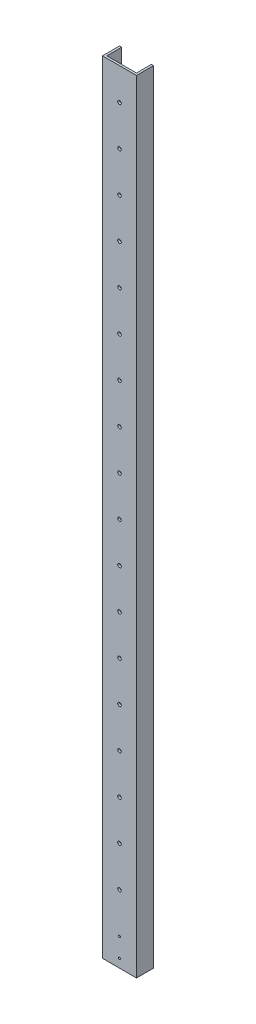
ISO-10303-21;
HEADER;
FILE_DESCRIPTION(('STEP AP214'),'2;1');
FILE_NAME('part.step','',(''),(''),'','','');
FILE_SCHEMA(('AUTOMOTIVE_DESIGN { 1 0 10303 214 1 1 1 1 }'));
ENDSEC;
DATA;
#1=APPLICATION_CONTEXT('core data for automotive mechanical design processes');
#2=APPLICATION_PROTOCOL_DEFINITION('international standard','automotive_design',2000,#1);
#3=PRODUCT_CONTEXT('',#1,'mechanical');
#4=PRODUCT('Part','Part','',(#3));
#5=PRODUCT_RELATED_PRODUCT_CATEGORY('part','',(#4));
#6=PRODUCT_DEFINITION_FORMATION('','',#4);
#7=PRODUCT_DEFINITION_CONTEXT('part definition',#1,'design');
#8=PRODUCT_DEFINITION('design','',#6,#7);
#9=PRODUCT_DEFINITION_SHAPE('','',#8);
#10=(LENGTH_UNIT() NAMED_UNIT(*) SI_UNIT(.MILLI.,.METRE.));
#11=(NAMED_UNIT(*) PLANE_ANGLE_UNIT() SI_UNIT($,.RADIAN.));
#12=(NAMED_UNIT(*) SI_UNIT($,.STERADIAN.) SOLID_ANGLE_UNIT());
#13=UNCERTAINTY_MEASURE_WITH_UNIT(LENGTH_MEASURE(1.E-05),#10,'distance_accuracy_value','');
#14=(GEOMETRIC_REPRESENTATION_CONTEXT(3) GLOBAL_UNCERTAINTY_ASSIGNED_CONTEXT((#13)) GLOBAL_UNIT_ASSIGNED_CONTEXT((#10,
#11,#12)) REPRESENTATION_CONTEXT('',''));
#15=CARTESIAN_POINT('',(0.,0.,0.));
#16=DIRECTION('',(0.,0.,1.));
#17=DIRECTION('',(1.,0.,0.));
#18=AXIS2_PLACEMENT_3D('',#15,#16,#17);
#19=CARTESIAN_POINT('',(0.,1168.4,0.));
#20=DIRECTION('',(1.,0.,0.));
#21=DIRECTION('',(0.,0.,-1.));
#22=AXIS2_PLACEMENT_3D('',#19,#20,#21);
#23=PLANE('',#22);
#24=DIRECTION('',(0.,0.,1.));
#25=VECTOR('',#24,1.);
#26=CARTESIAN_POINT('',(0.,0.,0.));
#27=LINE('',#26,#25);
#28=CARTESIAN_POINT('',(0.,0.,-25.4));
#29=VERTEX_POINT('',#28);
#30=CARTESIAN_POINT('',(0.,0.,0.));
#31=VERTEX_POINT('',#30);
#32=EDGE_CURVE('E129',#29,#31,#27,.T.);
#33=ORIENTED_EDGE('',*,*,#32,.T.);
#34=DIRECTION('',(0.,-1.,0.));
#35=VECTOR('',#34,1.);
#36=CARTESIAN_POINT('',(0.,1168.4,0.));
#37=LINE('',#36,#35);
#38=CARTESIAN_POINT('',(0.,1168.4,0.));
#39=VERTEX_POINT('',#38);
#40=EDGE_CURVE('E11',#39,#31,#37,.T.);
#41=ORIENTED_EDGE('',*,*,#40,.F.);
#42=DIRECTION('',(0.,0.,1.));
#43=VECTOR('',#42,1.);
#44=CARTESIAN_POINT('',(0.,1168.4,0.));
#45=LINE('',#44,#43);
#46=CARTESIAN_POINT('',(0.,1168.4,-25.4));
#47=VERTEX_POINT('',#46);
#48=EDGE_CURVE('E144',#47,#39,#45,.T.);
#49=ORIENTED_EDGE('',*,*,#48,.F.);
#50=DIRECTION('',(0.,-1.,0.));
#51=VECTOR('',#50,1.);
#52=CARTESIAN_POINT('',(0.,1168.4,-25.4));
#53=LINE('',#52,#51);
#54=EDGE_CURVE('E125',#47,#29,#53,.T.);
#55=ORIENTED_EDGE('',*,*,#54,.T.);
#56=EDGE_LOOP('',(#33,#41,#49,#55));
#57=FACE_BOUND('',#56,.T.);
#58=ADVANCED_FACE('F33',(#57),#23,.F.);
#59=CARTESIAN_POINT('',(0.,1168.4,0.));
#60=DIRECTION('',(0.,0.,-1.));
#61=DIRECTION('',(-1.,0.,0.));
#62=AXIS2_PLACEMENT_3D('',#59,#60,#61);
#63=PLANE('',#62);
#64=CARTESIAN_POINT('',(25.4,41.2749999999968,0.));
#65=DIRECTION('',(0.,0.,1.));
#66=DIRECTION('',(1.,0.,0.));
#67=AXIS2_PLACEMENT_3D('',#64,#65,#66);
#68=CIRCLE('',#67,1.5875);
#69=CARTESIAN_POINT('',(26.9875,41.2749999999968,0.));
#70=VERTEX_POINT('',#69);
#71=EDGE_CURVE('E288',#70,#70,#68,.T.);
#72=ORIENTED_EDGE('',*,*,#71,.F.);
#73=EDGE_LOOP('',(#72));
#74=FACE_BOUND('',#73,.T.);
#75=CARTESIAN_POINT('',(25.4,12.6999999999968,0.));
#76=DIRECTION('',(0.,0.,1.));
#77=DIRECTION('',(1.,0.,0.));
#78=AXIS2_PLACEMENT_3D('',#75,#76,#77);
#79=CIRCLE('',#78,1.5875);
#80=CARTESIAN_POINT('',(26.9875,12.6999999999968,0.));
#81=VERTEX_POINT('',#80);
#82=EDGE_CURVE('E289',#81,#81,#79,.T.);
#83=ORIENTED_EDGE('',*,*,#82,.F.);
#84=EDGE_LOOP('',(#83));
#85=FACE_BOUND('',#84,.T.);
#86=CARTESIAN_POINT('',(25.4,101.6,0.));
#87=DIRECTION('',(0.,0.,1.));
#88=DIRECTION('',(1.,0.,0.));
#89=AXIS2_PLACEMENT_3D('',#86,#87,#88);
#90=CIRCLE('',#89,2.667);
#91=CARTESIAN_POINT('',(28.067,101.6,0.));
#92=VERTEX_POINT('',#91);
#93=EDGE_CURVE('E278',#92,#92,#90,.T.);
#94=ORIENTED_EDGE('',*,*,#93,.F.);
#95=EDGE_LOOP('',(#94));
#96=FACE_BOUND('',#95,.T.);
#97=CARTESIAN_POINT('',(25.4,161.544,0.));
#98=DIRECTION('',(0.,0.,1.));
#99=DIRECTION('',(1.,0.,0.));
#100=AXIS2_PLACEMENT_3D('',#97,#98,#99);
#101=CIRCLE('',#100,2.667);
#102=CARTESIAN_POINT('',(28.067,161.544,0.));
#103=VERTEX_POINT('',#102);
#104=EDGE_CURVE('E272',#103,#103,#101,.T.);
#105=ORIENTED_EDGE('',*,*,#104,.F.);
#106=EDGE_LOOP('',(#105));
#107=FACE_BOUND('',#106,.T.);
#108=CARTESIAN_POINT('',(25.4,221.488,0.));
#109=DIRECTION('',(0.,0.,1.));
#110=DIRECTION('',(1.,0.,0.));
#111=AXIS2_PLACEMENT_3D('',#108,#109,#110);
#112=CIRCLE('',#111,2.667);
#113=CARTESIAN_POINT('',(28.067,221.488,0.));
#114=VERTEX_POINT('',#113);
#115=EDGE_CURVE('E266',#114,#114,#112,.T.);
#116=ORIENTED_EDGE('',*,*,#115,.F.);
#117=EDGE_LOOP('',(#116));
#118=FACE_BOUND('',#117,.T.);
#119=CARTESIAN_POINT('',(25.4,281.432,0.));
#120=DIRECTION('',(0.,0.,1.));
#121=DIRECTION('',(1.,0.,0.));
#122=AXIS2_PLACEMENT_3D('',#119,#120,#121);
#123=CIRCLE('',#122,2.667);
#124=CARTESIAN_POINT('',(28.067,281.432,0.));
#125=VERTEX_POINT('',#124);
#126=EDGE_CURVE('E260',#125,#125,#123,.T.);
#127=ORIENTED_EDGE('',*,*,#126,.F.);
#128=EDGE_LOOP('',(#127));
#129=FACE_BOUND('',#128,.T.);
#130=CARTESIAN_POINT('',(25.4,341.376,0.));
#131=DIRECTION('',(0.,0.,1.));
#132=DIRECTION('',(1.,0.,0.));
#133=AXIS2_PLACEMENT_3D('',#130,#131,#132);
#134=CIRCLE('',#133,2.667);
#135=CARTESIAN_POINT('',(28.067,341.376,0.));
#136=VERTEX_POINT('',#135);
#137=EDGE_CURVE('E254',#136,#136,#134,.T.);
#138=ORIENTED_EDGE('',*,*,#137,.F.);
#139=EDGE_LOOP('',(#138));
#140=FACE_BOUND('',#139,.T.);
#141=CARTESIAN_POINT('',(25.4,401.32,0.));
#142=DIRECTION('',(0.,0.,1.));
#143=DIRECTION('',(1.,0.,0.));
#144=AXIS2_PLACEMENT_3D('',#141,#142,#143);
#145=CIRCLE('',#144,2.667);
#146=CARTESIAN_POINT('',(28.067,401.32,0.));
#147=VERTEX_POINT('',#146);
#148=EDGE_CURVE('E248',#147,#147,#145,.T.);
#149=ORIENTED_EDGE('',*,*,#148,.F.);
#150=EDGE_LOOP('',(#149));
#151=FACE_BOUND('',#150,.T.);
#152=CARTESIAN_POINT('',(25.4,461.264,0.));
#153=DIRECTION('',(0.,0.,1.));
#154=DIRECTION('',(1.,0.,0.));
#155=AXIS2_PLACEMENT_3D('',#152,#153,#154);
#156=CIRCLE('',#155,2.667);
#157=CARTESIAN_POINT('',(28.067,461.264,0.));
#158=VERTEX_POINT('',#157);
#159=EDGE_CURVE('E242',#158,#158,#156,.T.);
#160=ORIENTED_EDGE('',*,*,#159,.F.);
#161=EDGE_LOOP('',(#160));
#162=FACE_BOUND('',#161,.T.);
#163=CARTESIAN_POINT('',(25.4,521.208,0.));
#164=DIRECTION('',(0.,0.,1.));
#165=DIRECTION('',(1.,0.,0.));
#166=AXIS2_PLACEMENT_3D('',#163,#164,#165);
#167=CIRCLE('',#166,2.667);
#168=CARTESIAN_POINT('',(28.067,521.208,0.));
#169=VERTEX_POINT('',#168);
#170=EDGE_CURVE('E236',#169,#169,#167,.T.);
#171=ORIENTED_EDGE('',*,*,#170,.F.);
#172=EDGE_LOOP('',(#171));
#173=FACE_BOUND('',#172,.T.);
#174=CARTESIAN_POINT('',(25.4,581.152,0.));
#175=DIRECTION('',(0.,0.,1.));
#176=DIRECTION('',(1.,0.,0.));
#177=AXIS2_PLACEMENT_3D('',#174,#175,#176);
#178=CIRCLE('',#177,2.667);
#179=CARTESIAN_POINT('',(28.067,581.152,0.));
#180=VERTEX_POINT('',#179);
#181=EDGE_CURVE('E230',#180,#180,#178,.T.);
#182=ORIENTED_EDGE('',*,*,#181,.F.);
#183=EDGE_LOOP('',(#182));
#184=FACE_BOUND('',#183,.T.);
#185=CARTESIAN_POINT('',(25.4,641.096,0.));
#186=DIRECTION('',(0.,0.,1.));
#187=DIRECTION('',(1.,0.,0.));
#188=AXIS2_PLACEMENT_3D('',#185,#186,#187);
#189=CIRCLE('',#188,2.66699999999997);
#190=CARTESIAN_POINT('',(28.067,641.096,0.));
#191=VERTEX_POINT('',#190);
#192=EDGE_CURVE('E224',#191,#191,#189,.T.);
#193=ORIENTED_EDGE('',*,*,#192,.F.);
#194=EDGE_LOOP('',(#193));
#195=FACE_BOUND('',#194,.T.);
#196=CARTESIAN_POINT('',(25.4,701.04,0.));
#197=DIRECTION('',(0.,0.,1.));
#198=DIRECTION('',(1.,0.,0.));
#199=AXIS2_PLACEMENT_3D('',#196,#197,#198);
#200=CIRCLE('',#199,2.66699999999994);
#201=CARTESIAN_POINT('',(28.0669999999999,701.04,0.));
#202=VERTEX_POINT('',#201);
#203=EDGE_CURVE('E218',#202,#202,#200,.T.);
#204=ORIENTED_EDGE('',*,*,#203,.F.);
#205=EDGE_LOOP('',(#204));
#206=FACE_BOUND('',#205,.T.);
#207=CARTESIAN_POINT('',(25.4,760.984,0.));
#208=DIRECTION('',(0.,0.,1.));
#209=DIRECTION('',(1.,0.,0.));
#210=AXIS2_PLACEMENT_3D('',#207,#208,#209);
#211=CIRCLE('',#210,2.667);
#212=CARTESIAN_POINT('',(28.067,760.984,0.));
#213=VERTEX_POINT('',#212);
#214=EDGE_CURVE('E212',#213,#213,#211,.T.);
#215=ORIENTED_EDGE('',*,*,#214,.F.);
#216=EDGE_LOOP('',(#215));
#217=FACE_BOUND('',#216,.T.);
#218=CARTESIAN_POINT('',(25.4,820.928,0.));
#219=DIRECTION('',(0.,0.,1.));
#220=DIRECTION('',(1.,0.,0.));
#221=AXIS2_PLACEMENT_3D('',#218,#219,#220);
#222=CIRCLE('',#221,2.667);
#223=CARTESIAN_POINT('',(28.067,820.928,0.));
#224=VERTEX_POINT('',#223);
#225=EDGE_CURVE('E206',#224,#224,#222,.T.);
#226=ORIENTED_EDGE('',*,*,#225,.F.);
#227=EDGE_LOOP('',(#226));
#228=FACE_BOUND('',#227,.T.);
#229=CARTESIAN_POINT('',(25.4,880.872,0.));
#230=DIRECTION('',(0.,0.,1.));
#231=DIRECTION('',(1.,0.,0.));
#232=AXIS2_PLACEMENT_3D('',#229,#230,#231);
#233=CIRCLE('',#232,2.667);
#234=CARTESIAN_POINT('',(28.067,880.872,0.));
#235=VERTEX_POINT('',#234);
#236=EDGE_CURVE('E200',#235,#235,#233,.T.);
#237=ORIENTED_EDGE('',*,*,#236,.F.);
#238=EDGE_LOOP('',(#237));
#239=FACE_BOUND('',#238,.T.);
#240=CARTESIAN_POINT('',(25.4,940.816,0.));
#241=DIRECTION('',(0.,0.,1.));
#242=DIRECTION('',(1.,0.,0.));
#243=AXIS2_PLACEMENT_3D('',#240,#241,#242);
#244=CIRCLE('',#243,2.667);
#245=CARTESIAN_POINT('',(28.067,940.816,0.));
#246=VERTEX_POINT('',#245);
#247=EDGE_CURVE('E194',#246,#246,#244,.T.);
#248=ORIENTED_EDGE('',*,*,#247,.F.);
#249=EDGE_LOOP('',(#248));
#250=FACE_BOUND('',#249,.T.);
#251=CARTESIAN_POINT('',(25.4,1000.76,0.));
#252=DIRECTION('',(0.,0.,1.));
#253=DIRECTION('',(1.,0.,0.));
#254=AXIS2_PLACEMENT_3D('',#251,#252,#253);
#255=CIRCLE('',#254,2.66700000000003);
#256=CARTESIAN_POINT('',(28.067,1000.76,0.));
#257=VERTEX_POINT('',#256);
#258=EDGE_CURVE('E188',#257,#257,#255,.T.);
#259=ORIENTED_EDGE('',*,*,#258,.F.);
#260=EDGE_LOOP('',(#259));
#261=FACE_BOUND('',#260,.T.);
#262=CARTESIAN_POINT('',(25.4,1060.704,0.));
#263=DIRECTION('',(0.,0.,1.));
#264=DIRECTION('',(1.,0.,0.));
#265=AXIS2_PLACEMENT_3D('',#262,#263,#264);
#266=CIRCLE('',#265,2.66700000000003);
#267=CARTESIAN_POINT('',(28.067,1060.704,0.));
#268=VERTEX_POINT('',#267);
#269=EDGE_CURVE('E180',#268,#268,#266,.T.);
#270=ORIENTED_EDGE('',*,*,#269,.F.);
#271=EDGE_LOOP('',(#270));
#272=FACE_BOUND('',#271,.T.);
#273=CARTESIAN_POINT('',(25.4,1120.648,0.));
#274=DIRECTION('',(0.,0.,1.));
#275=DIRECTION('',(1.,0.,0.));
#276=AXIS2_PLACEMENT_3D('',#273,#274,#275);
#277=CIRCLE('',#276,2.66700000000003);
#278=CARTESIAN_POINT('',(28.067,1120.648,0.));
#279=VERTEX_POINT('',#278);
#280=EDGE_CURVE('E181',#279,#279,#277,.T.);
#281=ORIENTED_EDGE('',*,*,#280,.F.);
#282=EDGE_LOOP('',(#281));
#283=FACE_BOUND('',#282,.T.);
#284=DIRECTION('',(1.,0.,0.));
#285=VECTOR('',#284,1.);
#286=CARTESIAN_POINT('',(0.,0.,0.));
#287=LINE('',#286,#285);
#288=CARTESIAN_POINT('',(50.8,0.,0.));
#289=VERTEX_POINT('',#288);
#290=EDGE_CURVE('E132',#31,#289,#287,.T.);
#291=ORIENTED_EDGE('',*,*,#290,.T.);
#292=DIRECTION('',(0.,-1.,0.));
#293=VECTOR('',#292,1.);
#294=CARTESIAN_POINT('',(50.8,1168.4,0.));
#295=LINE('',#294,#293);
#296=CARTESIAN_POINT('',(50.8,1168.4,0.));
#297=VERTEX_POINT('',#296);
#298=EDGE_CURVE('E41',#297,#289,#295,.T.);
#299=ORIENTED_EDGE('',*,*,#298,.F.);
#300=DIRECTION('',(1.,0.,0.));
#301=VECTOR('',#300,1.);
#302=CARTESIAN_POINT('',(0.,1168.4,0.));
#303=LINE('',#302,#301);
#304=EDGE_CURVE('E92',#39,#297,#303,.T.);
#305=ORIENTED_EDGE('',*,*,#304,.F.);
#306=ORIENTED_EDGE('',*,*,#40,.T.);
#307=EDGE_LOOP('',(#291,#299,#305,#306));
#308=FACE_BOUND('',#307,.T.);
#309=ADVANCED_FACE('F300',(#74,#85,#96,#107,#118,#129,#140,#151,#162,#173,#184,#195,#206,#217,
#228,#239,#250,#261,#272,#283,#308),#63,.F.);
#310=CARTESIAN_POINT('',(50.8,1168.4,0.));
#311=DIRECTION('',(-1.,0.,0.));
#312=DIRECTION('',(0.,0.,1.));
#313=AXIS2_PLACEMENT_3D('',#310,#311,#312);
#314=PLANE('',#313);
#315=DIRECTION('',(0.,0.,-1.));
#316=VECTOR('',#315,1.);
#317=CARTESIAN_POINT('',(50.8,0.,0.));
#318=LINE('',#317,#316);
#319=CARTESIAN_POINT('',(50.8,0.,-25.4));
#320=VERTEX_POINT('',#319);
#321=EDGE_CURVE('E135',#289,#320,#318,.T.);
#322=ORIENTED_EDGE('',*,*,#321,.T.);
#323=DIRECTION('',(0.,-1.,0.));
#324=VECTOR('',#323,1.);
#325=CARTESIAN_POINT('',(50.8,1168.4,-25.4));
#326=LINE('',#325,#324);
#327=CARTESIAN_POINT('',(50.8,1168.4,-25.4));
#328=VERTEX_POINT('',#327);
#329=EDGE_CURVE('E151',#328,#320,#326,.T.);
#330=ORIENTED_EDGE('',*,*,#329,.F.);
#331=DIRECTION('',(0.,0.,-1.));
#332=VECTOR('',#331,1.);
#333=CARTESIAN_POINT('',(50.8,1168.4,0.));
#334=LINE('',#333,#332);
#335=EDGE_CURVE('E159',#297,#328,#334,.T.);
#336=ORIENTED_EDGE('',*,*,#335,.F.);
#337=ORIENTED_EDGE('',*,*,#298,.T.);
#338=EDGE_LOOP('',(#322,#330,#336,#337));
#339=FACE_BOUND('',#338,.T.);
#340=ADVANCED_FACE('F157',(#339),#314,.F.);
#341=CARTESIAN_POINT('',(50.8,1168.4,-25.4));
#342=DIRECTION('',(0.,0.,1.));
#343=DIRECTION('',(1.,0.,0.));
#344=AXIS2_PLACEMENT_3D('',#341,#342,#343);
#345=PLANE('',#344);
#346=DIRECTION('',(-1.,0.,0.));
#347=VECTOR('',#346,1.);
#348=CARTESIAN_POINT('',(50.8,0.,-25.4));
#349=LINE('',#348,#347);
#350=CARTESIAN_POINT('',(47.625,0.,-25.4));
#351=VERTEX_POINT('',#350);
#352=EDGE_CURVE('E137',#320,#351,#349,.T.);
#353=ORIENTED_EDGE('',*,*,#352,.T.);
#354=DIRECTION('',(0.,-1.,0.));
#355=VECTOR('',#354,1.);
#356=CARTESIAN_POINT('',(47.625,1168.4,-25.4));
#357=LINE('',#356,#355);
#358=CARTESIAN_POINT('',(47.625,1168.4,-25.4));
#359=VERTEX_POINT('',#358);
#360=EDGE_CURVE('E148',#359,#351,#357,.T.);
#361=ORIENTED_EDGE('',*,*,#360,.F.);
#362=DIRECTION('',(-1.,0.,0.));
#363=VECTOR('',#362,1.);
#364=CARTESIAN_POINT('',(50.8,1168.4,-25.4));
#365=LINE('',#364,#363);
#366=EDGE_CURVE('E171',#328,#359,#365,.T.);
#367=ORIENTED_EDGE('',*,*,#366,.F.);
#368=ORIENTED_EDGE('',*,*,#329,.T.);
#369=EDGE_LOOP('',(#353,#361,#367,#368));
#370=FACE_BOUND('',#369,.T.);
#371=ADVANCED_FACE('F167',(#370),#345,.F.);
#372=CARTESIAN_POINT('',(47.625,1168.4,-3.175));
#373=DIRECTION('',(1.,0.,0.));
#374=DIRECTION('',(0.,0.,-1.));
#375=AXIS2_PLACEMENT_3D('',#372,#373,#374);
#376=PLANE('',#375);
#377=DIRECTION('',(0.,0.,1.));
#378=VECTOR('',#377,1.);
#379=CARTESIAN_POINT('',(47.625,0.,-3.175));
#380=LINE('',#379,#378);
#381=CARTESIAN_POINT('',(47.625,0.,-3.175));
#382=VERTEX_POINT('',#381);
#383=EDGE_CURVE('E139',#351,#382,#380,.T.);
#384=ORIENTED_EDGE('',*,*,#383,.T.);
#385=DIRECTION('',(0.,-1.,0.));
#386=VECTOR('',#385,1.);
#387=CARTESIAN_POINT('',(47.625,1168.4,-3.175));
#388=LINE('',#387,#386);
#389=CARTESIAN_POINT('',(47.625,1168.4,-3.175));
#390=VERTEX_POINT('',#389);
#391=EDGE_CURVE('E120',#390,#382,#388,.T.);
#392=ORIENTED_EDGE('',*,*,#391,.F.);
#393=DIRECTION('',(0.,0.,1.));
#394=VECTOR('',#393,1.);
#395=CARTESIAN_POINT('',(47.625,1168.4,-3.175));
#396=LINE('',#395,#394);
#397=EDGE_CURVE('E111',#359,#390,#396,.T.);
#398=ORIENTED_EDGE('',*,*,#397,.F.);
#399=ORIENTED_EDGE('',*,*,#360,.T.);
#400=EDGE_LOOP('',(#384,#392,#398,#399));
#401=FACE_BOUND('',#400,.T.);
#402=ADVANCED_FACE('F170',(#401),#376,.F.);
#403=CARTESIAN_POINT('',(3.175,1168.4,-3.175));
#404=DIRECTION('',(0.,0.,1.));
#405=DIRECTION('',(1.,0.,0.));
#406=AXIS2_PLACEMENT_3D('',#403,#404,#405);
#407=PLANE('',#406);
#408=CARTESIAN_POINT('',(25.4,41.2749999999968,-3.175));
#409=DIRECTION('',(0.,0.,1.));
#410=DIRECTION('',(1.,0.,0.));
#411=AXIS2_PLACEMENT_3D('',#408,#409,#410);
#412=CIRCLE('',#411,1.5875);
#413=CARTESIAN_POINT('',(26.9875,41.2749999999968,-3.175));
#414=VERTEX_POINT('',#413);
#415=EDGE_CURVE('E184',#414,#414,#412,.F.);
#416=ORIENTED_EDGE('',*,*,#415,.F.);
#417=EDGE_LOOP('',(#416));
#418=FACE_BOUND('',#417,.T.);
#419=CARTESIAN_POINT('',(25.4,12.6999999999968,-3.175));
#420=DIRECTION('',(0.,0.,1.));
#421=DIRECTION('',(1.,0.,0.));
#422=AXIS2_PLACEMENT_3D('',#419,#420,#421);
#423=CIRCLE('',#422,1.5875);
#424=CARTESIAN_POINT('',(26.9875,12.6999999999968,-3.175));
#425=VERTEX_POINT('',#424);
#426=EDGE_CURVE('E285',#425,#425,#423,.F.);
#427=ORIENTED_EDGE('',*,*,#426,.F.);
#428=EDGE_LOOP('',(#427));
#429=FACE_BOUND('',#428,.T.);
#430=CARTESIAN_POINT('',(25.4,101.6,-3.175));
#431=DIRECTION('',(0.,0.,1.));
#432=DIRECTION('',(1.,0.,0.));
#433=AXIS2_PLACEMENT_3D('',#430,#431,#432);
#434=CIRCLE('',#433,2.667);
#435=CARTESIAN_POINT('',(28.067,101.6,-3.175));
#436=VERTEX_POINT('',#435);
#437=EDGE_CURVE('E133',#436,#436,#434,.F.);
#438=ORIENTED_EDGE('',*,*,#437,.F.);
#439=EDGE_LOOP('',(#438));
#440=FACE_BOUND('',#439,.T.);
#441=CARTESIAN_POINT('',(25.4,161.544,-3.175));
#442=DIRECTION('',(0.,0.,1.));
#443=DIRECTION('',(1.,0.,0.));
#444=AXIS2_PLACEMENT_3D('',#441,#442,#443);
#445=CIRCLE('',#444,2.667);
#446=CARTESIAN_POINT('',(28.067,161.544,-3.175));
#447=VERTEX_POINT('',#446);
#448=EDGE_CURVE('E275',#447,#447,#445,.F.);
#449=ORIENTED_EDGE('',*,*,#448,.F.);
#450=EDGE_LOOP('',(#449));
#451=FACE_BOUND('',#450,.T.);
#452=CARTESIAN_POINT('',(25.4,221.488,-3.175));
#453=DIRECTION('',(0.,0.,1.));
#454=DIRECTION('',(1.,0.,0.));
#455=AXIS2_PLACEMENT_3D('',#452,#453,#454);
#456=CIRCLE('',#455,2.667);
#457=CARTESIAN_POINT('',(28.067,221.488,-3.175));
#458=VERTEX_POINT('',#457);
#459=EDGE_CURVE('E269',#458,#458,#456,.F.);
#460=ORIENTED_EDGE('',*,*,#459,.F.);
#461=EDGE_LOOP('',(#460));
#462=FACE_BOUND('',#461,.T.);
#463=CARTESIAN_POINT('',(25.4,281.432,-3.175));
#464=DIRECTION('',(0.,0.,1.));
#465=DIRECTION('',(1.,0.,0.));
#466=AXIS2_PLACEMENT_3D('',#463,#464,#465);
#467=CIRCLE('',#466,2.667);
#468=CARTESIAN_POINT('',(28.067,281.432,-3.175));
#469=VERTEX_POINT('',#468);
#470=EDGE_CURVE('E263',#469,#469,#467,.F.);
#471=ORIENTED_EDGE('',*,*,#470,.F.);
#472=EDGE_LOOP('',(#471));
#473=FACE_BOUND('',#472,.T.);
#474=CARTESIAN_POINT('',(25.4,341.376,-3.175));
#475=DIRECTION('',(0.,0.,1.));
#476=DIRECTION('',(1.,0.,0.));
#477=AXIS2_PLACEMENT_3D('',#474,#475,#476);
#478=CIRCLE('',#477,2.667);
#479=CARTESIAN_POINT('',(28.067,341.376,-3.175));
#480=VERTEX_POINT('',#479);
#481=EDGE_CURVE('E257',#480,#480,#478,.F.);
#482=ORIENTED_EDGE('',*,*,#481,.F.);
#483=EDGE_LOOP('',(#482));
#484=FACE_BOUND('',#483,.T.);
#485=CARTESIAN_POINT('',(25.4,401.32,-3.175));
#486=DIRECTION('',(0.,0.,1.));
#487=DIRECTION('',(1.,0.,0.));
#488=AXIS2_PLACEMENT_3D('',#485,#486,#487);
#489=CIRCLE('',#488,2.667);
#490=CARTESIAN_POINT('',(28.067,401.32,-3.175));
#491=VERTEX_POINT('',#490);
#492=EDGE_CURVE('E251',#491,#491,#489,.F.);
#493=ORIENTED_EDGE('',*,*,#492,.F.);
#494=EDGE_LOOP('',(#493));
#495=FACE_BOUND('',#494,.T.);
#496=CARTESIAN_POINT('',(25.4,461.264,-3.175));
#497=DIRECTION('',(0.,0.,1.));
#498=DIRECTION('',(1.,0.,0.));
#499=AXIS2_PLACEMENT_3D('',#496,#497,#498);
#500=CIRCLE('',#499,2.667);
#501=CARTESIAN_POINT('',(28.067,461.264,-3.175));
#502=VERTEX_POINT('',#501);
#503=EDGE_CURVE('E245',#502,#502,#500,.F.);
#504=ORIENTED_EDGE('',*,*,#503,.F.);
#505=EDGE_LOOP('',(#504));
#506=FACE_BOUND('',#505,.T.);
#507=CARTESIAN_POINT('',(25.4,521.208,-3.175));
#508=DIRECTION('',(0.,0.,1.));
#509=DIRECTION('',(1.,0.,0.));
#510=AXIS2_PLACEMENT_3D('',#507,#508,#509);
#511=CIRCLE('',#510,2.667);
#512=CARTESIAN_POINT('',(28.067,521.208,-3.175));
#513=VERTEX_POINT('',#512);
#514=EDGE_CURVE('E239',#513,#513,#511,.F.);
#515=ORIENTED_EDGE('',*,*,#514,.F.);
#516=EDGE_LOOP('',(#515));
#517=FACE_BOUND('',#516,.T.);
#518=CARTESIAN_POINT('',(25.4,581.152,-3.175));
#519=DIRECTION('',(0.,0.,1.));
#520=DIRECTION('',(1.,0.,0.));
#521=AXIS2_PLACEMENT_3D('',#518,#519,#520);
#522=CIRCLE('',#521,2.667);
#523=CARTESIAN_POINT('',(28.067,581.152,-3.175));
#524=VERTEX_POINT('',#523);
#525=EDGE_CURVE('E233',#524,#524,#522,.F.);
#526=ORIENTED_EDGE('',*,*,#525,.F.);
#527=EDGE_LOOP('',(#526));
#528=FACE_BOUND('',#527,.T.);
#529=CARTESIAN_POINT('',(25.4,641.096,-3.175));
#530=DIRECTION('',(0.,0.,1.));
#531=DIRECTION('',(1.,0.,0.));
#532=AXIS2_PLACEMENT_3D('',#529,#530,#531);
#533=CIRCLE('',#532,2.66699999999997);
#534=CARTESIAN_POINT('',(28.067,641.096,-3.175));
#535=VERTEX_POINT('',#534);
#536=EDGE_CURVE('E227',#535,#535,#533,.F.);
#537=ORIENTED_EDGE('',*,*,#536,.F.);
#538=EDGE_LOOP('',(#537));
#539=FACE_BOUND('',#538,.T.);
#540=CARTESIAN_POINT('',(25.4,701.04,-3.175));
#541=DIRECTION('',(0.,0.,1.));
#542=DIRECTION('',(1.,0.,0.));
#543=AXIS2_PLACEMENT_3D('',#540,#541,#542);
#544=CIRCLE('',#543,2.66699999999994);
#545=CARTESIAN_POINT('',(28.0669999999999,701.04,-3.175));
#546=VERTEX_POINT('',#545);
#547=EDGE_CURVE('E221',#546,#546,#544,.F.);
#548=ORIENTED_EDGE('',*,*,#547,.F.);
#549=EDGE_LOOP('',(#548));
#550=FACE_BOUND('',#549,.T.);
#551=CARTESIAN_POINT('',(25.4,760.984,-3.175));
#552=DIRECTION('',(0.,0.,1.));
#553=DIRECTION('',(1.,0.,0.));
#554=AXIS2_PLACEMENT_3D('',#551,#552,#553);
#555=CIRCLE('',#554,2.667);
#556=CARTESIAN_POINT('',(28.067,760.984,-3.175));
#557=VERTEX_POINT('',#556);
#558=EDGE_CURVE('E215',#557,#557,#555,.F.);
#559=ORIENTED_EDGE('',*,*,#558,.F.);
#560=EDGE_LOOP('',(#559));
#561=FACE_BOUND('',#560,.T.);
#562=CARTESIAN_POINT('',(25.4,820.928,-3.175));
#563=DIRECTION('',(0.,0.,1.));
#564=DIRECTION('',(1.,0.,0.));
#565=AXIS2_PLACEMENT_3D('',#562,#563,#564);
#566=CIRCLE('',#565,2.667);
#567=CARTESIAN_POINT('',(28.067,820.928,-3.175));
#568=VERTEX_POINT('',#567);
#569=EDGE_CURVE('E209',#568,#568,#566,.F.);
#570=ORIENTED_EDGE('',*,*,#569,.F.);
#571=EDGE_LOOP('',(#570));
#572=FACE_BOUND('',#571,.T.);
#573=CARTESIAN_POINT('',(25.4,880.872,-3.175));
#574=DIRECTION('',(0.,0.,1.));
#575=DIRECTION('',(1.,0.,0.));
#576=AXIS2_PLACEMENT_3D('',#573,#574,#575);
#577=CIRCLE('',#576,2.667);
#578=CARTESIAN_POINT('',(28.067,880.872,-3.175));
#579=VERTEX_POINT('',#578);
#580=EDGE_CURVE('E203',#579,#579,#577,.F.);
#581=ORIENTED_EDGE('',*,*,#580,.F.);
#582=EDGE_LOOP('',(#581));
#583=FACE_BOUND('',#582,.T.);
#584=CARTESIAN_POINT('',(25.4,940.816,-3.175));
#585=DIRECTION('',(0.,0.,1.));
#586=DIRECTION('',(1.,0.,0.));
#587=AXIS2_PLACEMENT_3D('',#584,#585,#586);
#588=CIRCLE('',#587,2.667);
#589=CARTESIAN_POINT('',(28.067,940.816,-3.175));
#590=VERTEX_POINT('',#589);
#591=EDGE_CURVE('E197',#590,#590,#588,.F.);
#592=ORIENTED_EDGE('',*,*,#591,.F.);
#593=EDGE_LOOP('',(#592));
#594=FACE_BOUND('',#593,.T.);
#595=CARTESIAN_POINT('',(25.4,1000.76,-3.175));
#596=DIRECTION('',(0.,0.,1.));
#597=DIRECTION('',(1.,0.,0.));
#598=AXIS2_PLACEMENT_3D('',#595,#596,#597);
#599=CIRCLE('',#598,2.66700000000003);
#600=CARTESIAN_POINT('',(28.067,1000.76,-3.175));
#601=VERTEX_POINT('',#600);
#602=EDGE_CURVE('E191',#601,#601,#599,.F.);
#603=ORIENTED_EDGE('',*,*,#602,.F.);
#604=EDGE_LOOP('',(#603));
#605=FACE_BOUND('',#604,.T.);
#606=CARTESIAN_POINT('',(25.4,1060.704,-3.175));
#607=DIRECTION('',(0.,0.,1.));
#608=DIRECTION('',(1.,0.,0.));
#609=AXIS2_PLACEMENT_3D('',#606,#607,#608);
#610=CIRCLE('',#609,2.66700000000003);
#611=CARTESIAN_POINT('',(28.067,1060.704,-3.175));
#612=VERTEX_POINT('',#611);
#613=EDGE_CURVE('E185',#612,#612,#610,.F.);
#614=ORIENTED_EDGE('',*,*,#613,.F.);
#615=EDGE_LOOP('',(#614));
#616=FACE_BOUND('',#615,.T.);
#617=CARTESIAN_POINT('',(25.4,1120.648,-3.175));
#618=DIRECTION('',(0.,0.,1.));
#619=DIRECTION('',(1.,0.,0.));
#620=AXIS2_PLACEMENT_3D('',#617,#618,#619);
#621=CIRCLE('',#620,2.66700000000003);
#622=CARTESIAN_POINT('',(28.067,1120.648,-3.175));
#623=VERTEX_POINT('',#622);
#624=EDGE_CURVE('E177',#623,#623,#621,.F.);
#625=ORIENTED_EDGE('',*,*,#624,.F.);
#626=EDGE_LOOP('',(#625));
#627=FACE_BOUND('',#626,.T.);
#628=DIRECTION('',(-1.,0.,0.));
#629=VECTOR('',#628,1.);
#630=CARTESIAN_POINT('',(3.175,0.,-3.175));
#631=LINE('',#630,#629);
#632=CARTESIAN_POINT('',(3.175,0.,-3.175));
#633=VERTEX_POINT('',#632);
#634=EDGE_CURVE('E119',#382,#633,#631,.T.);
#635=ORIENTED_EDGE('',*,*,#634,.T.);
#636=DIRECTION('',(0.,-1.,0.));
#637=VECTOR('',#636,1.);
#638=CARTESIAN_POINT('',(3.175,1168.4,-3.175));
#639=LINE('',#638,#637);
#640=CARTESIAN_POINT('',(3.175,1168.4,-3.175));
#641=VERTEX_POINT('',#640);
#642=EDGE_CURVE('E116',#641,#633,#639,.T.);
#643=ORIENTED_EDGE('',*,*,#642,.F.);
#644=DIRECTION('',(-1.,0.,0.));
#645=VECTOR('',#644,1.);
#646=CARTESIAN_POINT('',(3.175,1168.4,-3.175));
#647=LINE('',#646,#645);
#648=EDGE_CURVE('E105',#390,#641,#647,.T.);
#649=ORIENTED_EDGE('',*,*,#648,.F.);
#650=ORIENTED_EDGE('',*,*,#391,.T.);
#651=EDGE_LOOP('',(#635,#643,#649,#650));
#652=FACE_BOUND('',#651,.T.);
#653=ADVANCED_FACE('F117',(#418,#429,#440,#451,#462,#473,#484,#495,#506,#517,#528,#539,#550,
#561,#572,#583,#594,#605,#616,#627,#652),#407,.F.);
#654=CARTESIAN_POINT('',(3.175,1168.4,-3.175));
#655=DIRECTION('',(-1.,0.,0.));
#656=DIRECTION('',(0.,0.,1.));
#657=AXIS2_PLACEMENT_3D('',#654,#655,#656);
#658=PLANE('',#657);
#659=DIRECTION('',(0.,0.,-1.));
#660=VECTOR('',#659,1.);
#661=CARTESIAN_POINT('',(3.175,0.,-3.175));
#662=LINE('',#661,#660);
#663=CARTESIAN_POINT('',(3.175,0.,-25.4));
#664=VERTEX_POINT('',#663);
#665=EDGE_CURVE('E78',#633,#664,#662,.T.);
#666=ORIENTED_EDGE('',*,*,#665,.T.);
#667=DIRECTION('',(0.,-1.,0.));
#668=VECTOR('',#667,1.);
#669=CARTESIAN_POINT('',(3.175,1168.4,-25.4));
#670=LINE('',#669,#668);
#671=CARTESIAN_POINT('',(3.175,1168.4,-25.4));
#672=VERTEX_POINT('',#671);
#673=EDGE_CURVE('E121',#672,#664,#670,.T.);
#674=ORIENTED_EDGE('',*,*,#673,.F.);
#675=DIRECTION('',(0.,0.,-1.));
#676=VECTOR('',#675,1.);
#677=CARTESIAN_POINT('',(3.175,1168.4,-3.175));
#678=LINE('',#677,#676);
#679=EDGE_CURVE('E109',#641,#672,#678,.T.);
#680=ORIENTED_EDGE('',*,*,#679,.F.);
#681=ORIENTED_EDGE('',*,*,#642,.T.);
#682=EDGE_LOOP('',(#666,#674,#680,#681));
#683=FACE_BOUND('',#682,.T.);
#684=ADVANCED_FACE('F123',(#683),#658,.F.);
#685=CARTESIAN_POINT('',(0.,1168.4,-25.4));
#686=DIRECTION('',(0.,0.,1.));
#687=DIRECTION('',(1.,0.,0.));
#688=AXIS2_PLACEMENT_3D('',#685,#686,#687);
#689=PLANE('',#688);
#690=DIRECTION('',(-1.,0.,0.));
#691=VECTOR('',#690,1.);
#692=CARTESIAN_POINT('',(0.,0.,-25.4));
#693=LINE('',#692,#691);
#694=EDGE_CURVE('E84',#664,#29,#693,.T.);
#695=ORIENTED_EDGE('',*,*,#694,.T.);
#696=ORIENTED_EDGE('',*,*,#54,.F.);
#697=DIRECTION('',(-1.,0.,0.));
#698=VECTOR('',#697,1.);
#699=CARTESIAN_POINT('',(0.,1168.4,-25.4));
#700=LINE('',#699,#698);
#701=EDGE_CURVE('E49',#672,#47,#700,.T.);
#702=ORIENTED_EDGE('',*,*,#701,.F.);
#703=ORIENTED_EDGE('',*,*,#673,.T.);
#704=EDGE_LOOP('',(#695,#696,#702,#703));
#705=FACE_BOUND('',#704,.T.);
#706=ADVANCED_FACE('F343',(#705),#689,.F.);
#707=CARTESIAN_POINT('',(0.,1168.4,0.));
#708=DIRECTION('',(0.,-1.,0.));
#709=DIRECTION('',(0.,0.,-1.));
#710=AXIS2_PLACEMENT_3D('',#707,#708,#709);
#711=PLANE('',#710);
#712=ORIENTED_EDGE('',*,*,#48,.T.);
#713=ORIENTED_EDGE('',*,*,#304,.T.);
#714=ORIENTED_EDGE('',*,*,#335,.T.);
#715=ORIENTED_EDGE('',*,*,#366,.T.);
#716=ORIENTED_EDGE('',*,*,#397,.T.);
#717=ORIENTED_EDGE('',*,*,#648,.T.);
#718=ORIENTED_EDGE('',*,*,#679,.T.);
#719=ORIENTED_EDGE('',*,*,#701,.T.);
#720=EDGE_LOOP('',(#712,#713,#714,#715,#716,#717,#718,#719));
#721=FACE_BOUND('',#720,.T.);
#722=ADVANCED_FACE('F107',(#721),#711,.F.);
#723=CARTESIAN_POINT('',(0.,0.,0.));
#724=DIRECTION('',(0.,-1.,0.));
#725=DIRECTION('',(0.,0.,-1.));
#726=AXIS2_PLACEMENT_3D('',#723,#724,#725);
#727=PLANE('',#726);
#728=ORIENTED_EDGE('',*,*,#32,.F.);
#729=ORIENTED_EDGE('',*,*,#694,.F.);
#730=ORIENTED_EDGE('',*,*,#665,.F.);
#731=ORIENTED_EDGE('',*,*,#634,.F.);
#732=ORIENTED_EDGE('',*,*,#383,.F.);
#733=ORIENTED_EDGE('',*,*,#352,.F.);
#734=ORIENTED_EDGE('',*,*,#321,.F.);
#735=ORIENTED_EDGE('',*,*,#290,.F.);
#736=EDGE_LOOP('',(#728,#729,#730,#731,#732,#733,#734,#735));
#737=FACE_BOUND('',#736,.T.);
#738=ADVANCED_FACE('F163',(#737),#727,.T.);
#739=CARTESIAN_POINT('',(25.4,1120.648,-25.401));
#740=DIRECTION('',(0.,0.,1.));
#741=DIRECTION('',(1.,0.,0.));
#742=AXIS2_PLACEMENT_3D('',#739,#740,#741);
#743=CYLINDRICAL_SURFACE('',#742,2.66700000000003);
#744=ORIENTED_EDGE('',*,*,#280,.T.);
#745=EDGE_LOOP('',(#744));
#746=FACE_BOUND('',#745,.T.);
#747=ORIENTED_EDGE('',*,*,#624,.T.);
#748=EDGE_LOOP('',(#747));
#749=FACE_BOUND('',#748,.T.);
#750=ADVANCED_FACE('F410',(#746,#749),#743,.F.);
#751=CARTESIAN_POINT('',(25.4,1060.704,-25.401));
#752=DIRECTION('',(0.,0.,1.));
#753=DIRECTION('',(1.,0.,0.));
#754=AXIS2_PLACEMENT_3D('',#751,#752,#753);
#755=CYLINDRICAL_SURFACE('',#754,2.66700000000003);
#756=ORIENTED_EDGE('',*,*,#269,.T.);
#757=EDGE_LOOP('',(#756));
#758=FACE_BOUND('',#757,.T.);
#759=ORIENTED_EDGE('',*,*,#613,.T.);
#760=EDGE_LOOP('',(#759));
#761=FACE_BOUND('',#760,.T.);
#762=ADVANCED_FACE('F418',(#758,#761),#755,.F.);
#763=CARTESIAN_POINT('',(25.4,1000.76,-25.401));
#764=DIRECTION('',(0.,0.,1.));
#765=DIRECTION('',(1.,0.,0.));
#766=AXIS2_PLACEMENT_3D('',#763,#764,#765);
#767=CYLINDRICAL_SURFACE('',#766,2.66700000000003);
#768=ORIENTED_EDGE('',*,*,#258,.T.);
#769=EDGE_LOOP('',(#768));
#770=FACE_BOUND('',#769,.T.);
#771=ORIENTED_EDGE('',*,*,#602,.T.);
#772=EDGE_LOOP('',(#771));
#773=FACE_BOUND('',#772,.T.);
#774=ADVANCED_FACE('F428',(#770,#773),#767,.F.);
#775=CARTESIAN_POINT('',(25.4,940.816,-25.401));
#776=DIRECTION('',(0.,0.,1.));
#777=DIRECTION('',(1.,0.,0.));
#778=AXIS2_PLACEMENT_3D('',#775,#776,#777);
#779=CYLINDRICAL_SURFACE('',#778,2.667);
#780=ORIENTED_EDGE('',*,*,#247,.T.);
#781=EDGE_LOOP('',(#780));
#782=FACE_BOUND('',#781,.T.);
#783=ORIENTED_EDGE('',*,*,#591,.T.);
#784=EDGE_LOOP('',(#783));
#785=FACE_BOUND('',#784,.T.);
#786=ADVANCED_FACE('F438',(#782,#785),#779,.F.);
#787=CARTESIAN_POINT('',(25.4,880.872,-25.401));
#788=DIRECTION('',(0.,0.,1.));
#789=DIRECTION('',(1.,0.,0.));
#790=AXIS2_PLACEMENT_3D('',#787,#788,#789);
#791=CYLINDRICAL_SURFACE('',#790,2.667);
#792=ORIENTED_EDGE('',*,*,#236,.T.);
#793=EDGE_LOOP('',(#792));
#794=FACE_BOUND('',#793,.T.);
#795=ORIENTED_EDGE('',*,*,#580,.T.);
#796=EDGE_LOOP('',(#795));
#797=FACE_BOUND('',#796,.T.);
#798=ADVANCED_FACE('F448',(#794,#797),#791,.F.);
#799=CARTESIAN_POINT('',(25.4,820.928,-25.401));
#800=DIRECTION('',(0.,0.,1.));
#801=DIRECTION('',(1.,0.,0.));
#802=AXIS2_PLACEMENT_3D('',#799,#800,#801);
#803=CYLINDRICAL_SURFACE('',#802,2.667);
#804=ORIENTED_EDGE('',*,*,#225,.T.);
#805=EDGE_LOOP('',(#804));
#806=FACE_BOUND('',#805,.T.);
#807=ORIENTED_EDGE('',*,*,#569,.T.);
#808=EDGE_LOOP('',(#807));
#809=FACE_BOUND('',#808,.T.);
#810=ADVANCED_FACE('F458',(#806,#809),#803,.F.);
#811=CARTESIAN_POINT('',(25.4,760.984,-25.401));
#812=DIRECTION('',(0.,0.,1.));
#813=DIRECTION('',(1.,0.,0.));
#814=AXIS2_PLACEMENT_3D('',#811,#812,#813);
#815=CYLINDRICAL_SURFACE('',#814,2.667);
#816=ORIENTED_EDGE('',*,*,#214,.T.);
#817=EDGE_LOOP('',(#816));
#818=FACE_BOUND('',#817,.T.);
#819=ORIENTED_EDGE('',*,*,#558,.T.);
#820=EDGE_LOOP('',(#819));
#821=FACE_BOUND('',#820,.T.);
#822=ADVANCED_FACE('F468',(#818,#821),#815,.F.);
#823=CARTESIAN_POINT('',(25.4,701.04,-25.401));
#824=DIRECTION('',(0.,0.,1.));
#825=DIRECTION('',(1.,0.,0.));
#826=AXIS2_PLACEMENT_3D('',#823,#824,#825);
#827=CYLINDRICAL_SURFACE('',#826,2.66699999999994);
#828=ORIENTED_EDGE('',*,*,#203,.T.);
#829=EDGE_LOOP('',(#828));
#830=FACE_BOUND('',#829,.T.);
#831=ORIENTED_EDGE('',*,*,#547,.T.);
#832=EDGE_LOOP('',(#831));
#833=FACE_BOUND('',#832,.T.);
#834=ADVANCED_FACE('F478',(#830,#833),#827,.F.);
#835=CARTESIAN_POINT('',(25.4,641.096,-25.401));
#836=DIRECTION('',(0.,0.,1.));
#837=DIRECTION('',(1.,0.,0.));
#838=AXIS2_PLACEMENT_3D('',#835,#836,#837);
#839=CYLINDRICAL_SURFACE('',#838,2.66699999999997);
#840=ORIENTED_EDGE('',*,*,#192,.T.);
#841=EDGE_LOOP('',(#840));
#842=FACE_BOUND('',#841,.T.);
#843=ORIENTED_EDGE('',*,*,#536,.T.);
#844=EDGE_LOOP('',(#843));
#845=FACE_BOUND('',#844,.T.);
#846=ADVANCED_FACE('F488',(#842,#845),#839,.F.);
#847=CARTESIAN_POINT('',(25.4,581.152,-25.401));
#848=DIRECTION('',(0.,0.,1.));
#849=DIRECTION('',(1.,0.,0.));
#850=AXIS2_PLACEMENT_3D('',#847,#848,#849);
#851=CYLINDRICAL_SURFACE('',#850,2.667);
#852=ORIENTED_EDGE('',*,*,#181,.T.);
#853=EDGE_LOOP('',(#852));
#854=FACE_BOUND('',#853,.T.);
#855=ORIENTED_EDGE('',*,*,#525,.T.);
#856=EDGE_LOOP('',(#855));
#857=FACE_BOUND('',#856,.T.);
#858=ADVANCED_FACE('F498',(#854,#857),#851,.F.);
#859=CARTESIAN_POINT('',(25.4,521.208,-25.401));
#860=DIRECTION('',(0.,0.,1.));
#861=DIRECTION('',(1.,0.,0.));
#862=AXIS2_PLACEMENT_3D('',#859,#860,#861);
#863=CYLINDRICAL_SURFACE('',#862,2.667);
#864=ORIENTED_EDGE('',*,*,#170,.T.);
#865=EDGE_LOOP('',(#864));
#866=FACE_BOUND('',#865,.T.);
#867=ORIENTED_EDGE('',*,*,#514,.T.);
#868=EDGE_LOOP('',(#867));
#869=FACE_BOUND('',#868,.T.);
#870=ADVANCED_FACE('F508',(#866,#869),#863,.F.);
#871=CARTESIAN_POINT('',(25.4,461.264,-25.401));
#872=DIRECTION('',(0.,0.,1.));
#873=DIRECTION('',(1.,0.,0.));
#874=AXIS2_PLACEMENT_3D('',#871,#872,#873);
#875=CYLINDRICAL_SURFACE('',#874,2.667);
#876=ORIENTED_EDGE('',*,*,#159,.T.);
#877=EDGE_LOOP('',(#876));
#878=FACE_BOUND('',#877,.T.);
#879=ORIENTED_EDGE('',*,*,#503,.T.);
#880=EDGE_LOOP('',(#879));
#881=FACE_BOUND('',#880,.T.);
#882=ADVANCED_FACE('F518',(#878,#881),#875,.F.);
#883=CARTESIAN_POINT('',(25.4,401.32,-25.401));
#884=DIRECTION('',(0.,0.,1.));
#885=DIRECTION('',(1.,0.,0.));
#886=AXIS2_PLACEMENT_3D('',#883,#884,#885);
#887=CYLINDRICAL_SURFACE('',#886,2.667);
#888=ORIENTED_EDGE('',*,*,#148,.T.);
#889=EDGE_LOOP('',(#888));
#890=FACE_BOUND('',#889,.T.);
#891=ORIENTED_EDGE('',*,*,#492,.T.);
#892=EDGE_LOOP('',(#891));
#893=FACE_BOUND('',#892,.T.);
#894=ADVANCED_FACE('F528',(#890,#893),#887,.F.);
#895=CARTESIAN_POINT('',(25.4,341.376,-25.401));
#896=DIRECTION('',(0.,0.,1.));
#897=DIRECTION('',(1.,0.,0.));
#898=AXIS2_PLACEMENT_3D('',#895,#896,#897);
#899=CYLINDRICAL_SURFACE('',#898,2.667);
#900=ORIENTED_EDGE('',*,*,#137,.T.);
#901=EDGE_LOOP('',(#900));
#902=FACE_BOUND('',#901,.T.);
#903=ORIENTED_EDGE('',*,*,#481,.T.);
#904=EDGE_LOOP('',(#903));
#905=FACE_BOUND('',#904,.T.);
#906=ADVANCED_FACE('F538',(#902,#905),#899,.F.);
#907=CARTESIAN_POINT('',(25.4,281.432,-25.401));
#908=DIRECTION('',(0.,0.,1.));
#909=DIRECTION('',(1.,0.,0.));
#910=AXIS2_PLACEMENT_3D('',#907,#908,#909);
#911=CYLINDRICAL_SURFACE('',#910,2.667);
#912=ORIENTED_EDGE('',*,*,#126,.T.);
#913=EDGE_LOOP('',(#912));
#914=FACE_BOUND('',#913,.T.);
#915=ORIENTED_EDGE('',*,*,#470,.T.);
#916=EDGE_LOOP('',(#915));
#917=FACE_BOUND('',#916,.T.);
#918=ADVANCED_FACE('F548',(#914,#917),#911,.F.);
#919=CARTESIAN_POINT('',(25.4,221.488,-25.401));
#920=DIRECTION('',(0.,0.,1.));
#921=DIRECTION('',(1.,0.,0.));
#922=AXIS2_PLACEMENT_3D('',#919,#920,#921);
#923=CYLINDRICAL_SURFACE('',#922,2.667);
#924=ORIENTED_EDGE('',*,*,#115,.T.);
#925=EDGE_LOOP('',(#924));
#926=FACE_BOUND('',#925,.T.);
#927=ORIENTED_EDGE('',*,*,#459,.T.);
#928=EDGE_LOOP('',(#927));
#929=FACE_BOUND('',#928,.T.);
#930=ADVANCED_FACE('F558',(#926,#929),#923,.F.);
#931=CARTESIAN_POINT('',(25.4,161.544,-25.401));
#932=DIRECTION('',(0.,0.,1.));
#933=DIRECTION('',(1.,0.,0.));
#934=AXIS2_PLACEMENT_3D('',#931,#932,#933);
#935=CYLINDRICAL_SURFACE('',#934,2.667);
#936=ORIENTED_EDGE('',*,*,#104,.T.);
#937=EDGE_LOOP('',(#936));
#938=FACE_BOUND('',#937,.T.);
#939=ORIENTED_EDGE('',*,*,#448,.T.);
#940=EDGE_LOOP('',(#939));
#941=FACE_BOUND('',#940,.T.);
#942=ADVANCED_FACE('F568',(#938,#941),#935,.F.);
#943=CARTESIAN_POINT('',(25.4,101.6,-25.401));
#944=DIRECTION('',(0.,0.,1.));
#945=DIRECTION('',(1.,0.,0.));
#946=AXIS2_PLACEMENT_3D('',#943,#944,#945);
#947=CYLINDRICAL_SURFACE('',#946,2.667);
#948=ORIENTED_EDGE('',*,*,#93,.T.);
#949=EDGE_LOOP('',(#948));
#950=FACE_BOUND('',#949,.T.);
#951=ORIENTED_EDGE('',*,*,#437,.T.);
#952=EDGE_LOOP('',(#951));
#953=FACE_BOUND('',#952,.T.);
#954=ADVANCED_FACE('F577',(#950,#953),#947,.F.);
#955=CARTESIAN_POINT('',(25.4,12.6999999999968,-25.401));
#956=DIRECTION('',(0.,0.,1.));
#957=DIRECTION('',(1.,0.,0.));
#958=AXIS2_PLACEMENT_3D('',#955,#956,#957);
#959=CYLINDRICAL_SURFACE('',#958,1.5875);
#960=ORIENTED_EDGE('',*,*,#82,.T.);
#961=EDGE_LOOP('',(#960));
#962=FACE_BOUND('',#961,.T.);
#963=ORIENTED_EDGE('',*,*,#426,.T.);
#964=EDGE_LOOP('',(#963));
#965=FACE_BOUND('',#964,.T.);
#966=ADVANCED_FACE('F586',(#962,#965),#959,.F.);
#967=CARTESIAN_POINT('',(25.4,41.2749999999968,-25.401));
#968=DIRECTION('',(0.,0.,1.));
#969=DIRECTION('',(1.,0.,0.));
#970=AXIS2_PLACEMENT_3D('',#967,#968,#969);
#971=CYLINDRICAL_SURFACE('',#970,1.5875);
#972=ORIENTED_EDGE('',*,*,#71,.T.);
#973=EDGE_LOOP('',(#972));
#974=FACE_BOUND('',#973,.T.);
#975=ORIENTED_EDGE('',*,*,#415,.T.);
#976=EDGE_LOOP('',(#975));
#977=FACE_BOUND('',#976,.T.);
#978=ADVANCED_FACE('F297',(#974,#977),#971,.F.);
#979=CLOSED_SHELL('',(#58,#309,#340,#371,#402,#653,#684,#706,#722,#738,#750,#762,#774,#786,#798,
#810,#822,#834,#846,#858,#870,#882,#894,#906,#918,#930,#942,#954,#966,#978));
#980=MANIFOLD_SOLID_BREP('B2',#979);
#981=ADVANCED_BREP_SHAPE_REPRESENTATION('',(#18,#980),#14);
#982=SHAPE_DEFINITION_REPRESENTATION(#9,#981);
ENDSEC;
END-ISO-10303-21;
